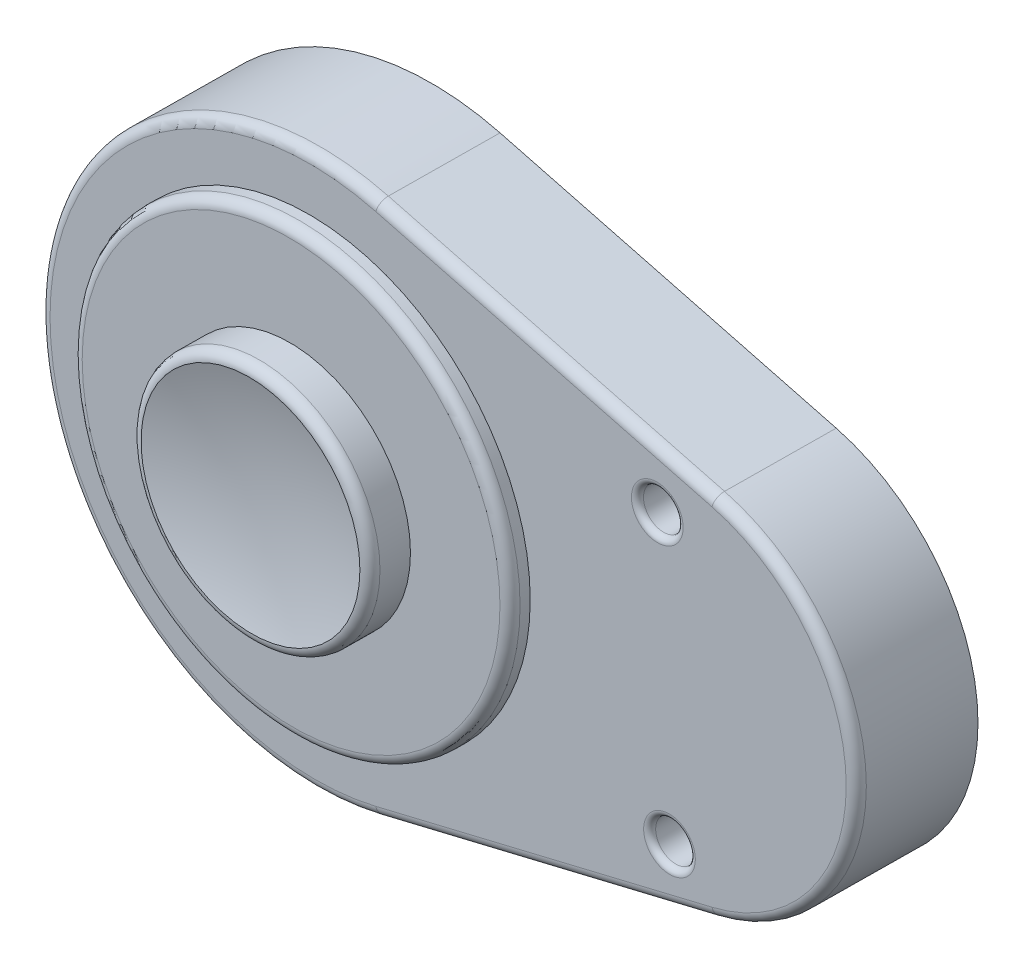
ISO-10303-21;
HEADER;
FILE_DESCRIPTION(('STEP AP214'),'2;1');
FILE_NAME('part.step','',(''),(''),'','','');
FILE_SCHEMA(('AUTOMOTIVE_DESIGN { 1 0 10303 214 1 1 1 1 }'));
ENDSEC;
DATA;
#1=APPLICATION_CONTEXT('core data for automotive mechanical design processes');
#2=APPLICATION_PROTOCOL_DEFINITION('international standard','automotive_design',2000,#1);
#3=PRODUCT_CONTEXT('',#1,'mechanical');
#4=PRODUCT('Part','Part','',(#3));
#5=PRODUCT_RELATED_PRODUCT_CATEGORY('part','',(#4));
#6=PRODUCT_DEFINITION_FORMATION('','',#4);
#7=PRODUCT_DEFINITION_CONTEXT('part definition',#1,'design');
#8=PRODUCT_DEFINITION('design','',#6,#7);
#9=PRODUCT_DEFINITION_SHAPE('','',#8);
#10=(LENGTH_UNIT() NAMED_UNIT(*) SI_UNIT(.MILLI.,.METRE.));
#11=(NAMED_UNIT(*) PLANE_ANGLE_UNIT() SI_UNIT($,.RADIAN.));
#12=(NAMED_UNIT(*) SI_UNIT($,.STERADIAN.) SOLID_ANGLE_UNIT());
#13=UNCERTAINTY_MEASURE_WITH_UNIT(LENGTH_MEASURE(1.E-05),#10,'distance_accuracy_value','');
#14=(GEOMETRIC_REPRESENTATION_CONTEXT(3) GLOBAL_UNCERTAINTY_ASSIGNED_CONTEXT((#13)) GLOBAL_UNIT_ASSIGNED_CONTEXT((#10,
#11,#12)) REPRESENTATION_CONTEXT('',''));
#15=CARTESIAN_POINT('',(0.,0.,0.));
#16=DIRECTION('',(0.,0.,1.));
#17=DIRECTION('',(1.,0.,0.));
#18=AXIS2_PLACEMENT_3D('',#15,#16,#17);
#19=CARTESIAN_POINT('',(-0.913899219910125,294.000000000001,89.995359814914));
#20=DIRECTION('',(0.0101544357767432,0.,-0.999948442387934));
#21=DIRECTION('',(-0.999948442387934,0.,-0.0101544357767432));
#22=AXIS2_PLACEMENT_3D('',#19,#20,#21);
#23=CYLINDRICAL_SURFACE('',#22,46.9225149813001);
#24=DIRECTION('',(0.0101544357767432,0.,-0.999948442387934));
#25=VECTOR('',#24,1.);
#26=CARTESIAN_POINT('',(10.3753588625768,339.544065709367,90.1100017717452));
#27=LINE('',#26,#25);
#28=CARTESIAN_POINT('',(10.4007449520186,339.544065709367,87.6101306657754));
#29=VERTEX_POINT('',#28);
#30=CARTESIAN_POINT('',(10.6799919358791,339.544065709367,60.1115485001072));
#31=VERTEX_POINT('',#30);
#32=EDGE_CURVE('E88',#29,#31,#27,.T.);
#33=ORIENTED_EDGE('',*,*,#32,.F.);
#34=CARTESIAN_POINT('',(-0.888513130468267,294.000000000001,87.4954887089442));
#35=DIRECTION('',(-0.0101544357767432,0.,0.999948442387934));
#36=DIRECTION('',(0.999948442387934,0.,0.0101544357767432));
#37=AXIS2_PLACEMENT_3D('',#34,#35,#36);
#38=CIRCLE('',#37,46.9225149813001);
#39=CARTESIAN_POINT('',(10.4007449520186,248.455934290634,87.6101306657754));
#40=VERTEX_POINT('',#39);
#41=EDGE_CURVE('E146',#29,#40,#38,.F.);
#42=ORIENTED_EDGE('',*,*,#41,.T.);
#43=DIRECTION('',(0.0101544357767432,0.,-0.999948442387934));
#44=VECTOR('',#43,1.);
#45=CARTESIAN_POINT('',(10.3753588625768,248.455934290634,90.1100017717452));
#46=LINE('',#45,#44);
#47=CARTESIAN_POINT('',(10.6799919358791,248.455934290634,60.1115485001072));
#48=VERTEX_POINT('',#47);
#49=EDGE_CURVE('E110',#40,#48,#46,.T.);
#50=ORIENTED_EDGE('',*,*,#49,.T.);
#51=CARTESIAN_POINT('',(-0.609266146607829,294.000000000001,59.996906543276));
#52=DIRECTION('',(-0.0101544357767432,0.,0.999948442387934));
#53=DIRECTION('',(0.999948442387934,0.,0.0101544357767432));
#54=AXIS2_PLACEMENT_3D('',#51,#52,#53);
#55=CIRCLE('',#54,46.9225149813001);
#56=EDGE_CURVE('E106',#48,#31,#55,.T.);
#57=ORIENTED_EDGE('',*,*,#56,.T.);
#58=EDGE_LOOP('',(#33,#42,#50,#57));
#59=FACE_BOUND('',#58,.T.);
#60=ADVANCED_FACE('F33',(#59),#23,.T.);
#61=CARTESIAN_POINT('',(10.3753588625768,339.544065709367,90.1100017717452));
#62=DIRECTION('',(-0.240593627323387,-0.970622860422481,-0.00244321850346071));
#63=DIRECTION('',(0.970625757413055,-0.240594345416375,0.));
#64=AXIS2_PLACEMENT_3D('',#61,#62,#63);
#65=PLANE('',#64);
#66=DIRECTION('',(0.0101544357767432,0.,-0.999948442387934));
#67=VECTOR('',#66,1.);
#68=CARTESIAN_POINT('',(-74.1083462192989,360.487665938941,89.2520731815606));
#69=LINE('',#68,#67);
#70=CARTESIAN_POINT('',(-74.082960129857,360.487665938941,86.7522020755908));
#71=VERTEX_POINT('',#70);
#72=CARTESIAN_POINT('',(-73.8037131459966,360.487665938941,59.2536199099226));
#73=VERTEX_POINT('',#72);
#74=EDGE_CURVE('E100',#71,#73,#69,.T.);
#75=ORIENTED_EDGE('',*,*,#74,.F.);
#76=DIRECTION('',(-0.970572817425582,0.240606032395866,-0.00985612749959888));
#77=VECTOR('',#76,1.);
#78=CARTESIAN_POINT('',(10.4007449520186,339.544065709367,87.6101306657754));
#79=LINE('',#78,#77);
#80=EDGE_CURVE('E94',#71,#29,#79,.F.);
#81=ORIENTED_EDGE('',*,*,#80,.T.);
#82=ORIENTED_EDGE('',*,*,#32,.T.);
#83=DIRECTION('',(-0.970572817425581,0.240606032395866,-0.00985612749959894));
#84=VECTOR('',#83,1.);
#85=CARTESIAN_POINT('',(10.6799919358791,339.544065709367,60.1115485001072));
#86=LINE('',#85,#84);
#87=EDGE_CURVE('E91',#31,#73,#86,.T.);
#88=ORIENTED_EDGE('',*,*,#87,.T.);
#89=EDGE_LOOP('',(#75,#81,#82,#88));
#90=FACE_BOUND('',#89,.T.);
#91=ADVANCED_FACE('F90',(#90),#65,.F.);
#92=CARTESIAN_POINT('',(-90.5890096909508,294.000000000001,89.0847127140735));
#93=DIRECTION('',(0.0101544357767432,0.,-0.999948442387934));
#94=DIRECTION('',(-0.999948442387934,0.,-0.0101544357767432));
#95=AXIS2_PLACEMENT_3D('',#92,#93,#94);
#96=CYLINDRICAL_SURFACE('',#95,68.5);
#97=DIRECTION('',(0.0101544357767432,0.,-0.999948442387934));
#98=VECTOR('',#97,1.);
#99=CARTESIAN_POINT('',(-74.1083462192989,227.512334061061,89.2520731815606));
#100=LINE('',#99,#98);
#101=CARTESIAN_POINT('',(-74.082960129857,227.512334061061,86.7522020755908));
#102=VERTEX_POINT('',#101);
#103=CARTESIAN_POINT('',(-73.8037131459966,227.512334061061,59.2536199099226));
#104=VERTEX_POINT('',#103);
#105=EDGE_CURVE('E124',#102,#104,#100,.T.);
#106=ORIENTED_EDGE('',*,*,#105,.F.);
#107=CARTESIAN_POINT('',(-90.563623601509,294.000000000001,86.5848416081037));
#108=DIRECTION('',(-0.0101544357767432,0.,0.999948442387934));
#109=DIRECTION('',(0.999948442387934,0.,0.0101544357767432));
#110=AXIS2_PLACEMENT_3D('',#107,#108,#109);
#111=CIRCLE('',#110,68.5);
#112=EDGE_CURVE('E49',#102,#71,#111,.F.);
#113=ORIENTED_EDGE('',*,*,#112,.T.);
#114=ORIENTED_EDGE('',*,*,#74,.T.);
#115=CARTESIAN_POINT('',(-90.2843766176485,294.000000000001,59.0862594424355));
#116=DIRECTION('',(-0.0101544357767432,0.,0.999948442387934));
#117=DIRECTION('',(0.999948442387934,0.,0.0101544357767432));
#118=AXIS2_PLACEMENT_3D('',#115,#116,#117);
#119=CIRCLE('',#118,68.5);
#120=EDGE_CURVE('E108',#73,#104,#119,.T.);
#121=ORIENTED_EDGE('',*,*,#120,.T.);
#122=EDGE_LOOP('',(#106,#113,#114,#121));
#123=FACE_BOUND('',#122,.T.);
#124=ADVANCED_FACE('F217',(#123),#96,.T.);
#125=CARTESIAN_POINT('',(-74.1083462192989,227.512334061061,89.2520731815606));
#126=DIRECTION('',(-0.240593627323385,0.970622860422482,-0.0024432185034609));
#127=DIRECTION('',(-0.970625757413055,-0.240594345416374,0.));
#128=AXIS2_PLACEMENT_3D('',#125,#126,#127);
#129=PLANE('',#128);
#130=ORIENTED_EDGE('',*,*,#49,.F.);
#131=DIRECTION('',(0.970572817425582,0.240606032395864,0.00985612749959883));
#132=VECTOR('',#131,1.);
#133=CARTESIAN_POINT('',(-74.082960129857,227.512334061061,86.7522020755908));
#134=LINE('',#133,#132);
#135=EDGE_CURVE('E57',#40,#102,#134,.F.);
#136=ORIENTED_EDGE('',*,*,#135,.T.);
#137=ORIENTED_EDGE('',*,*,#105,.T.);
#138=DIRECTION('',(0.970572817425582,0.240606032395864,0.00985612749959879));
#139=VECTOR('',#138,1.);
#140=CARTESIAN_POINT('',(-73.8037131459966,227.512334061061,59.2536199099226));
#141=LINE('',#140,#139);
#142=EDGE_CURVE('E121',#104,#48,#141,.T.);
#143=ORIENTED_EDGE('',*,*,#142,.T.);
#144=EDGE_LOOP('',(#130,#136,#137,#143));
#145=FACE_BOUND('',#144,.T.);
#146=ADVANCED_FACE('F209',(#145),#129,.F.);
#147=CARTESIAN_POINT('',(-0.913899219910125,294.000000000001,89.995359814914));
#148=DIRECTION('',(-0.0101544357767432,0.,0.999948442387934));
#149=DIRECTION('',(0.999948442387934,0.,0.0101544357767432));
#150=AXIS2_PLACEMENT_3D('',#147,#148,#149);
#151=PLANE('',#150);
#152=CARTESIAN_POINT('',(-0.913899219910086,259.067133874063,89.995359814914));
#153=DIRECTION('',(-0.0101544357767432,0.,0.999948442387934));
#154=DIRECTION('',(0.999948442387934,0.,0.0101544357767432));
#155=AXIS2_PLACEMENT_3D('',#152,#153,#154);
#156=CIRCLE('',#155,6.50000000000002);
#157=CARTESIAN_POINT('',(5.58576565561151,259.067133874063,90.0613636474629));
#158=VERTEX_POINT('',#157);
#159=EDGE_CURVE('E42',#158,#158,#156,.F.);
#160=ORIENTED_EDGE('',*,*,#159,.T.);
#161=EDGE_LOOP('',(#160));
#162=FACE_BOUND('',#161,.T.);
#163=CARTESIAN_POINT('',(-3.97874289420973,329.000000000001,89.9642364520113));
#164=DIRECTION('',(-0.0101544357767432,0.,0.999948442387934));
#165=DIRECTION('',(0.999948442387934,0.,0.0101544357767432));
#166=AXIS2_PLACEMENT_3D('',#163,#164,#165);
#167=CIRCLE('',#166,6.5);
#168=CARTESIAN_POINT('',(2.52092198131185,329.000000000001,90.0302402845602));
#169=VERTEX_POINT('',#168);
#170=EDGE_CURVE('E172',#169,#169,#167,.F.);
#171=ORIENTED_EDGE('',*,*,#170,.T.);
#172=EDGE_LOOP('',(#171));
#173=FACE_BOUND('',#172,.T.);
#174=DIRECTION('',(0.970572817425582,0.240606032395864,0.00985612749959883));
#175=VECTOR('',#174,1.);
#176=CARTESIAN_POINT('',(9.77387479426833,250.882491441691,90.1038937254866));
#177=LINE('',#176,#175);
#178=CARTESIAN_POINT('',(-74.7098302876073,229.938891212117,89.245965135302));
#179=VERTEX_POINT('',#178);
#180=CARTESIAN_POINT('',(9.77387479426833,250.882491441691,90.1038937254866));
#181=VERTEX_POINT('',#180);
#182=EDGE_CURVE('E141',#179,#181,#177,.T.);
#183=ORIENTED_EDGE('',*,*,#182,.T.);
#184=CARTESIAN_POINT('',(-0.913899219910125,294.000000000001,89.995359814914));
#185=DIRECTION('',(-0.0101544357767432,0.,0.999948442387934));
#186=DIRECTION('',(0.999948442387934,0.,0.0101544357767432));
#187=AXIS2_PLACEMENT_3D('',#184,#185,#186);
#188=CIRCLE('',#187,44.4225149813001);
#189=CARTESIAN_POINT('',(9.7738747942683,337.117508558311,90.1038937254866));
#190=VERTEX_POINT('',#189);
#191=EDGE_CURVE('E143',#181,#190,#188,.T.);
#192=ORIENTED_EDGE('',*,*,#191,.T.);
#193=DIRECTION('',(-0.970572817425582,0.240606032395866,-0.00985612749959888));
#194=VECTOR('',#193,1.);
#195=CARTESIAN_POINT('',(-74.7098302876074,358.061108787885,89.2459651353019));
#196=LINE('',#195,#194);
#197=CARTESIAN_POINT('',(-74.7098302876074,358.061108787885,89.2459651353019));
#198=VERTEX_POINT('',#197);
#199=EDGE_CURVE('E136',#190,#198,#196,.T.);
#200=ORIENTED_EDGE('',*,*,#199,.T.);
#201=CARTESIAN_POINT('',(-90.5890096909508,294.000000000001,89.0847127140735));
#202=DIRECTION('',(-0.0101544357767432,0.,0.999948442387934));
#203=DIRECTION('',(0.999948442387934,0.,0.0101544357767432));
#204=AXIS2_PLACEMENT_3D('',#201,#202,#203);
#205=CIRCLE('',#204,66.);
#206=EDGE_CURVE('E138',#198,#179,#205,.T.);
#207=ORIENTED_EDGE('',*,*,#206,.T.);
#208=EDGE_LOOP('',(#183,#192,#200,#207));
#209=FACE_BOUND('',#208,.T.);
#210=CARTESIAN_POINT('',(-90.9046190889751,294.000000000001,89.0815077134686));
#211=DIRECTION('',(-0.0101544357767432,0.,0.999948442387934));
#212=DIRECTION('',(0.999948442387934,0.,0.0101544357767432));
#213=AXIS2_PLACEMENT_3D('',#210,#211,#212);
#214=CIRCLE('',#213,55.);
#215=CARTESIAN_POINT('',(-35.9074547576387,294.000000000001,89.6400016811895));
#216=VERTEX_POINT('',#215);
#217=EDGE_CURVE('E99',#216,#216,#214,.T.);
#218=ORIENTED_EDGE('',*,*,#217,.F.);
#219=EDGE_LOOP('',(#218));
#220=FACE_BOUND('',#219,.T.);
#221=ADVANCED_FACE('F178',(#162,#173,#209,#220),#151,.T.);
#222=CARTESIAN_POINT('',(-0.609266146607829,294.000000000001,59.996906543276));
#223=DIRECTION('',(-0.0101544357767432,0.,0.999948442387934));
#224=DIRECTION('',(0.999948442387934,0.,0.0101544357767432));
#225=AXIS2_PLACEMENT_3D('',#222,#223,#224);
#226=PLANE('',#225);
#227=CARTESIAN_POINT('',(-3.67410982090744,329.000000000001,59.9657831803733));
#228=DIRECTION('',(-0.0101544357767432,0.,0.999948442387934));
#229=DIRECTION('',(0.999948442387934,0.,0.0101544357767432));
#230=AXIS2_PLACEMENT_3D('',#227,#228,#229);
#231=CIRCLE('',#230,3.0000000000433);
#232=CARTESIAN_POINT('',(-0.674264493700337,329.000000000001,59.9962464877039));
#233=VERTEX_POINT('',#232);
#234=EDGE_CURVE('E130',#233,#233,#231,.T.);
#235=ORIENTED_EDGE('',*,*,#234,.T.);
#236=EDGE_LOOP('',(#235));
#237=FACE_BOUND('',#236,.T.);
#238=CARTESIAN_POINT('',(-0.60926614660779,259.067133874063,59.996906543276));
#239=DIRECTION('',(-0.0101544357767432,0.,0.999948442387934));
#240=DIRECTION('',(0.999948442387934,0.,0.0101544357767432));
#241=AXIS2_PLACEMENT_3D('',#238,#239,#240);
#242=CIRCLE('',#241,3.00000000022555);
#243=CARTESIAN_POINT('',(2.39057918078155,259.067133874063,60.0273698506085));
#244=VERTEX_POINT('',#243);
#245=EDGE_CURVE('E135',#244,#244,#242,.T.);
#246=ORIENTED_EDGE('',*,*,#245,.T.);
#247=EDGE_LOOP('',(#246));
#248=FACE_BOUND('',#247,.T.);
#249=ORIENTED_EDGE('',*,*,#56,.F.);
#250=ORIENTED_EDGE('',*,*,#142,.F.);
#251=ORIENTED_EDGE('',*,*,#120,.F.);
#252=ORIENTED_EDGE('',*,*,#87,.F.);
#253=EDGE_LOOP('',(#249,#250,#251,#252));
#254=FACE_BOUND('',#253,.T.);
#255=ADVANCED_FACE('F104',(#237,#248,#254),#226,.F.);
#256=CARTESIAN_POINT('',(-90.9553912678588,294.000000000001,94.0812499254083));
#257=DIRECTION('',(0.0101544357767432,0.,-0.999948442387934));
#258=DIRECTION('',(-0.999948442387934,0.,-0.0101544357767432));
#259=AXIS2_PLACEMENT_3D('',#256,#257,#258);
#260=CYLINDRICAL_SURFACE('',#259,55.);
#261=CARTESIAN_POINT('',(-90.930005178417,294.000000000001,91.5813788194384));
#262=DIRECTION('',(-0.0101544357767432,0.,0.999948442387934));
#263=DIRECTION('',(0.999948442387934,0.,0.0101544357767432));
#264=AXIS2_PLACEMENT_3D('',#261,#262,#263);
#265=CIRCLE('',#264,55.);
#266=CARTESIAN_POINT('',(-35.9328408470806,294.000000000001,92.1398727871593));
#267=VERTEX_POINT('',#266);
#268=EDGE_CURVE('E153',#267,#267,#265,.F.);
#269=ORIENTED_EDGE('',*,*,#268,.T.);
#270=EDGE_LOOP('',(#269));
#271=FACE_BOUND('',#270,.T.);
#272=ORIENTED_EDGE('',*,*,#217,.T.);
#273=EDGE_LOOP('',(#272));
#274=FACE_BOUND('',#273,.T.);
#275=ADVANCED_FACE('F206',(#271,#274),#260,.T.);
#276=CARTESIAN_POINT('',(-90.9553912678588,294.000000000001,94.0812499254083));
#277=DIRECTION('',(-0.0101544357767432,0.,0.999948442387934));
#278=DIRECTION('',(0.999948442387934,0.,0.0101544357767432));
#279=AXIS2_PLACEMENT_3D('',#276,#277,#278);
#280=PLANE('',#279);
#281=CARTESIAN_POINT('',(-90.9553912678588,294.000000000001,94.0812499254083));
#282=DIRECTION('',(-0.0101544357767432,0.,0.999948442387934));
#283=DIRECTION('',(0.999948442387934,0.,0.0101544357767432));
#284=AXIS2_PLACEMENT_3D('',#281,#282,#283);
#285=CIRCLE('',#284,52.5);
#286=CARTESIAN_POINT('',(-38.4580980424923,294.000000000001,94.6143578036873));
#287=VERTEX_POINT('',#286);
#288=EDGE_CURVE('E150',#287,#287,#285,.T.);
#289=ORIENTED_EDGE('',*,*,#288,.T.);
#290=EDGE_LOOP('',(#289));
#291=FACE_BOUND('',#290,.T.);
#292=CARTESIAN_POINT('',(-90.9553912678588,294.000000000001,94.0812499254083));
#293=DIRECTION('',(-0.0101544357767432,0.,0.999948442387934));
#294=DIRECTION('',(0.999948442387934,0.,0.0101544357767432));
#295=AXIS2_PLACEMENT_3D('',#292,#293,#294);
#296=CIRCLE('',#295,30.);
#297=CARTESIAN_POINT('',(-60.9569379962208,294.000000000001,94.3858829987106));
#298=VERTEX_POINT('',#297);
#299=EDGE_CURVE('E139',#298,#298,#296,.T.);
#300=ORIENTED_EDGE('',*,*,#299,.F.);
#301=EDGE_LOOP('',(#300));
#302=FACE_BOUND('',#301,.T.);
#303=ADVANCED_FACE('F284',(#291,#302),#280,.T.);
#304=CARTESIAN_POINT('',(-91.0569356256263,294.000000000001,104.080734349288));
#305=DIRECTION('',(0.0101544357767432,0.,-0.999948442387934));
#306=DIRECTION('',(-0.999948442387934,0.,-0.0101544357767432));
#307=AXIS2_PLACEMENT_3D('',#304,#305,#306);
#308=CYLINDRICAL_SURFACE('',#307,30.);
#309=CARTESIAN_POINT('',(-91.0315495361844,294.000000000001,101.580863243318));
#310=DIRECTION('',(-0.0101544357767432,0.,0.999948442387934));
#311=DIRECTION('',(0.999948442387934,0.,0.0101544357767432));
#312=AXIS2_PLACEMENT_3D('',#309,#310,#311);
#313=CIRCLE('',#312,30.);
#314=CARTESIAN_POINT('',(-61.0330962645464,294.000000000001,101.88549631662));
#315=VERTEX_POINT('',#314);
#316=EDGE_CURVE('E156',#315,#315,#313,.F.);
#317=ORIENTED_EDGE('',*,*,#316,.T.);
#318=EDGE_LOOP('',(#317));
#319=FACE_BOUND('',#318,.T.);
#320=ORIENTED_EDGE('',*,*,#299,.T.);
#321=EDGE_LOOP('',(#320));
#322=FACE_BOUND('',#321,.T.);
#323=ADVANCED_FACE('F281',(#319,#322),#308,.T.);
#324=CARTESIAN_POINT('',(-91.996538261093,294.000000000001,196.607213658996));
#325=DIRECTION('',(0.,0.,1.));
#326=DIRECTION('',(1.,0.,0.));
#327=AXIS2_PLACEMENT_3D('',#324,#325,#326);
#328=SPHERICAL_SURFACE('',#327,96.5312499999999);
#329=CARTESIAN_POINT('',(-91.996538261093,294.000000000001,196.607213658996));
#330=DIRECTION('',(-0.0101544357767432,0.,0.999948442387934));
#331=DIRECTION('',(0.999948442387934,0.,0.0101544357767432));
#332=AXIS2_PLACEMENT_3D('',#329,#330,#331);
#333=SPHERICAL_SURFACE('',#332,96.5312499999999);
#334=CARTESIAN_POINT('',(-91.0569356256263,294.000000000001,104.080734349288));
#335=DIRECTION('',(-0.0101544357767432,0.,0.999948442387934));
#336=DIRECTION('',(0.999948442387934,0.,0.0101544357767432));
#337=AXIS2_PLACEMENT_3D('',#334,#335,#336);
#338=CIRCLE('',#337,27.5);
#339=CARTESIAN_POINT('',(-63.5583534599581,294.000000000001,104.359981333148));
#340=VERTEX_POINT('',#339);
#341=EDGE_CURVE('E37',#340,#340,#338,.T.);
#342=ORIENTED_EDGE('',*,*,#341,.T.);
#343=EDGE_LOOP('',(#342));
#344=FACE_BOUND('',#343,.T.);
#345=ADVANCED_FACE('F35',(#344),#333,.F.);
#346=CARTESIAN_POINT('',(-0.710810504375222,259.067133874063,69.9963909671554));
#347=DIRECTION('',(-0.0101544357767432,0.,0.999948442387934));
#348=DIRECTION('',(0.999948442387934,0.,0.0101544357767432));
#349=AXIS2_PLACEMENT_3D('',#346,#347,#348);
#350=CYLINDRICAL_SURFACE('',#349,5.00000000000002);
#351=CARTESIAN_POINT('',(-0.898667566244971,259.067133874063,88.4954371513321));
#352=DIRECTION('',(-0.0101544357767432,0.,0.999948442387934));
#353=DIRECTION('',(0.999948442387934,0.,0.0101544357767432));
#354=AXIS2_PLACEMENT_3D('',#351,#352,#353);
#355=CIRCLE('',#354,5.00000000000002);
#356=CARTESIAN_POINT('',(4.10107464569472,259.067133874063,88.5462093302158));
#357=VERTEX_POINT('',#356);
#358=EDGE_CURVE('E160',#357,#357,#355,.T.);
#359=ORIENTED_EDGE('',*,*,#358,.T.);
#360=EDGE_LOOP('',(#359));
#361=FACE_BOUND('',#360,.T.);
#362=CARTESIAN_POINT('',(-0.710810504375222,259.067133874063,69.9963909671554));
#363=DIRECTION('',(-0.0101544357767432,0.,0.999948442387934));
#364=DIRECTION('',(0.999948442387934,0.,0.0101544357767432));
#365=AXIS2_PLACEMENT_3D('',#362,#363,#364);
#366=CIRCLE('',#365,5.00000000000002);
#367=CARTESIAN_POINT('',(4.28893170756447,259.067133874063,70.0471631460391));
#368=VERTEX_POINT('',#367);
#369=EDGE_CURVE('E115',#368,#368,#366,.T.);
#370=ORIENTED_EDGE('',*,*,#369,.F.);
#371=EDGE_LOOP('',(#370));
#372=FACE_BOUND('',#371,.T.);
#373=ADVANCED_FACE('F189',(#361,#372),#350,.F.);
#374=CARTESIAN_POINT('',(-0.710810504375222,259.067133874063,69.9963909671554));
#375=DIRECTION('',(-0.0101544357767432,0.,0.999948442387934));
#376=DIRECTION('',(0.999948442387934,0.,0.0101544357767432));
#377=AXIS2_PLACEMENT_3D('',#374,#375,#376);
#378=PLANE('',#377);
#379=CARTESIAN_POINT('',(-0.710810504375222,259.067133874063,69.9963909671554));
#380=DIRECTION('',(-0.0101544357767432,0.,0.999948442387934));
#381=DIRECTION('',(0.999948442387934,0.,0.0101544357767432));
#382=AXIS2_PLACEMENT_3D('',#379,#380,#381);
#383=CIRCLE('',#382,3.00000000022555);
#384=CARTESIAN_POINT('',(2.28903482301412,259.067133874063,70.0268542744879));
#385=VERTEX_POINT('',#384);
#386=EDGE_CURVE('E132',#385,#385,#383,.T.);
#387=ORIENTED_EDGE('',*,*,#386,.F.);
#388=EDGE_LOOP('',(#387));
#389=FACE_BOUND('',#388,.T.);
#390=ORIENTED_EDGE('',*,*,#369,.T.);
#391=EDGE_LOOP('',(#390));
#392=FACE_BOUND('',#391,.T.);
#393=ADVANCED_FACE('F192',(#389,#392),#378,.T.);
#394=CARTESIAN_POINT('',(-3.77565417867487,329.000000000001,69.9652676042526));
#395=DIRECTION('',(-0.0101544357767432,0.,0.999948442387934));
#396=DIRECTION('',(0.999948442387934,0.,0.0101544357767432));
#397=AXIS2_PLACEMENT_3D('',#394,#395,#396);
#398=CYLINDRICAL_SURFACE('',#397,5.);
#399=CARTESIAN_POINT('',(-3.96351124054462,329.000000000001,88.4643137884294));
#400=DIRECTION('',(-0.0101544357767432,0.,0.999948442387934));
#401=DIRECTION('',(0.999948442387934,0.,0.0101544357767432));
#402=AXIS2_PLACEMENT_3D('',#399,#400,#401);
#403=CIRCLE('',#402,5.);
#404=CARTESIAN_POINT('',(1.03623097139506,329.000000000001,88.5150859673131));
#405=VERTEX_POINT('',#404);
#406=EDGE_CURVE('E11',#405,#405,#403,.T.);
#407=ORIENTED_EDGE('',*,*,#406,.T.);
#408=EDGE_LOOP('',(#407));
#409=FACE_BOUND('',#408,.T.);
#410=CARTESIAN_POINT('',(-3.77565417867487,329.000000000001,69.9652676042526));
#411=DIRECTION('',(-0.0101544357767432,0.,0.999948442387934));
#412=DIRECTION('',(0.999948442387934,0.,0.0101544357767432));
#413=AXIS2_PLACEMENT_3D('',#410,#411,#412);
#414=CIRCLE('',#413,5.);
#415=CARTESIAN_POINT('',(1.22408803326481,329.000000000001,70.0160397831364));
#416=VERTEX_POINT('',#415);
#417=EDGE_CURVE('E112',#416,#416,#414,.T.);
#418=ORIENTED_EDGE('',*,*,#417,.F.);
#419=EDGE_LOOP('',(#418));
#420=FACE_BOUND('',#419,.T.);
#421=ADVANCED_FACE('F259',(#409,#420),#398,.F.);
#422=CARTESIAN_POINT('',(-3.77565417867487,329.000000000001,69.9652676042526));
#423=DIRECTION('',(-0.0101544357767432,0.,0.999948442387934));
#424=DIRECTION('',(0.999948442387934,0.,0.0101544357767432));
#425=AXIS2_PLACEMENT_3D('',#422,#423,#424);
#426=PLANE('',#425);
#427=CARTESIAN_POINT('',(-3.77565417867487,329.000000000001,69.9652676042526));
#428=DIRECTION('',(-0.0101544357767432,0.,0.999948442387934));
#429=DIRECTION('',(0.999948442387934,0.,0.0101544357767432));
#430=AXIS2_PLACEMENT_3D('',#427,#428,#429);
#431=CIRCLE('',#430,3.0000000000433);
#432=CARTESIAN_POINT('',(-0.775808851467769,329.000000000001,69.9957309115833));
#433=VERTEX_POINT('',#432);
#434=EDGE_CURVE('E127',#433,#433,#431,.T.);
#435=ORIENTED_EDGE('',*,*,#434,.F.);
#436=EDGE_LOOP('',(#435));
#437=FACE_BOUND('',#436,.T.);
#438=ORIENTED_EDGE('',*,*,#417,.T.);
#439=EDGE_LOOP('',(#438));
#440=FACE_BOUND('',#439,.T.);
#441=ADVANCED_FACE('F262',(#437,#440),#426,.T.);
#442=CARTESIAN_POINT('',(-3.65296229209155,329.000000000001,57.8833003162603));
#443=DIRECTION('',(-0.0101544357767432,0.,0.999948442387934));
#444=DIRECTION('',(0.999948442387934,0.,0.0101544357767432));
#445=AXIS2_PLACEMENT_3D('',#442,#443,#444);
#446=CYLINDRICAL_SURFACE('',#445,3.0000000000433);
#447=ORIENTED_EDGE('',*,*,#434,.T.);
#448=EDGE_LOOP('',(#447));
#449=FACE_BOUND('',#448,.T.);
#450=ORIENTED_EDGE('',*,*,#234,.F.);
#451=EDGE_LOOP('',(#450));
#452=FACE_BOUND('',#451,.T.);
#453=ADVANCED_FACE('F267',(#449,#452),#446,.F.);
#454=CARTESIAN_POINT('',(-0.588118617791899,259.067133874063,57.914423679163));
#455=DIRECTION('',(-0.0101544357767432,0.,0.999948442387934));
#456=DIRECTION('',(0.999948442387934,0.,0.0101544357767432));
#457=AXIS2_PLACEMENT_3D('',#454,#455,#456);
#458=CYLINDRICAL_SURFACE('',#457,3.00000000022555);
#459=ORIENTED_EDGE('',*,*,#386,.T.);
#460=EDGE_LOOP('',(#459));
#461=FACE_BOUND('',#460,.T.);
#462=ORIENTED_EDGE('',*,*,#245,.F.);
#463=EDGE_LOOP('',(#462));
#464=FACE_BOUND('',#463,.T.);
#465=ADVANCED_FACE('F244',(#461,#464),#458,.F.);
#466=CARTESIAN_POINT('',(-90.563623601509,294.000000000001,86.5848416081037));
#467=DIRECTION('',(-0.0101544357767432,0.,0.999948442387934));
#468=DIRECTION('',(0.999948442387934,0.,0.0101544357767432));
#469=AXIS2_PLACEMENT_3D('',#466,#467,#468);
#470=TOROIDAL_SURFACE('',#469,66.,2.5);
#471=CARTESIAN_POINT('',(-74.6844441981655,358.061108787885,86.7460940293321));
#472=DIRECTION('',(0.970572817425582,-0.240606032395865,0.0098561274995992));
#473=DIRECTION('',(0.240617719873284,0.970619963159105,0.));
#474=AXIS2_PLACEMENT_3D('',#471,#472,#473);
#475=CIRCLE('',#474,2.5);
#476=EDGE_CURVE('E165',#71,#198,#475,.T.);
#477=ORIENTED_EDGE('',*,*,#476,.F.);
#478=ORIENTED_EDGE('',*,*,#112,.F.);
#479=CARTESIAN_POINT('',(-74.6844441981655,229.938891212117,86.7460940293321));
#480=DIRECTION('',(0.970572817425581,0.240606032395868,0.00985612749959924));
#481=DIRECTION('',(-0.240617719873287,0.970619963159104,0.));
#482=AXIS2_PLACEMENT_3D('',#479,#480,#481);
#483=CIRCLE('',#482,2.5);
#484=EDGE_CURVE('E131',#179,#102,#483,.T.);
#485=ORIENTED_EDGE('',*,*,#484,.F.);
#486=ORIENTED_EDGE('',*,*,#206,.F.);
#487=EDGE_LOOP('',(#477,#478,#485,#486));
#488=FACE_BOUND('',#487,.T.);
#489=ADVANCED_FACE('F240',(#488),#470,.T.);
#490=CARTESIAN_POINT('',(9.79926088371015,250.882491441691,87.6040226195168));
#491=DIRECTION('',(-0.970572817425582,-0.240606032395864,-0.00985612749959883));
#492=DIRECTION('',(0.240617719873283,-0.970619963159105,0.));
#493=AXIS2_PLACEMENT_3D('',#490,#491,#492);
#494=CYLINDRICAL_SURFACE('',#493,2.5);
#495=ORIENTED_EDGE('',*,*,#484,.T.);
#496=ORIENTED_EDGE('',*,*,#135,.F.);
#497=CARTESIAN_POINT('',(9.79926088371019,250.882491441691,87.6040226195168));
#498=DIRECTION('',(0.970572817425582,0.240606032395865,0.00985612749959858));
#499=DIRECTION('',(-0.240617719873284,0.970619963159105,0.));
#500=AXIS2_PLACEMENT_3D('',#497,#498,#499);
#501=CIRCLE('',#500,2.5);
#502=EDGE_CURVE('E163',#181,#40,#501,.T.);
#503=ORIENTED_EDGE('',*,*,#502,.F.);
#504=ORIENTED_EDGE('',*,*,#182,.F.);
#505=EDGE_LOOP('',(#495,#496,#503,#504));
#506=FACE_BOUND('',#505,.T.);
#507=ADVANCED_FACE('F236',(#506),#494,.T.);
#508=CARTESIAN_POINT('',(9.79926088371021,337.117508558311,87.6040226195168));
#509=DIRECTION('',(0.970572817425582,-0.240606032395866,0.00985612749959888));
#510=DIRECTION('',(0.240617719873285,0.970619963159104,0.));
#511=AXIS2_PLACEMENT_3D('',#508,#509,#510);
#512=CYLINDRICAL_SURFACE('',#511,2.5);
#513=ORIENTED_EDGE('',*,*,#476,.T.);
#514=ORIENTED_EDGE('',*,*,#199,.F.);
#515=CARTESIAN_POINT('',(9.79926088371015,337.117508558311,87.6040226195168));
#516=DIRECTION('',(0.970572817425582,-0.240606032395865,0.00985612749959723));
#517=DIRECTION('',(0.240617719873284,0.970619963159105,0.));
#518=AXIS2_PLACEMENT_3D('',#515,#516,#517);
#519=CIRCLE('',#518,2.5);
#520=EDGE_CURVE('E161',#29,#190,#519,.T.);
#521=ORIENTED_EDGE('',*,*,#520,.F.);
#522=ORIENTED_EDGE('',*,*,#80,.F.);
#523=EDGE_LOOP('',(#513,#514,#521,#522));
#524=FACE_BOUND('',#523,.T.);
#525=ADVANCED_FACE('F232',(#524),#512,.T.);
#526=CARTESIAN_POINT('',(-0.888513130468267,294.000000000001,87.4954887089442));
#527=DIRECTION('',(-0.0101544357767432,0.,0.999948442387934));
#528=DIRECTION('',(0.999948442387934,0.,0.0101544357767432));
#529=AXIS2_PLACEMENT_3D('',#526,#527,#528);
#530=TOROIDAL_SURFACE('',#529,44.4225149813001,2.5);
#531=ORIENTED_EDGE('',*,*,#502,.T.);
#532=ORIENTED_EDGE('',*,*,#41,.F.);
#533=ORIENTED_EDGE('',*,*,#520,.T.);
#534=ORIENTED_EDGE('',*,*,#191,.F.);
#535=EDGE_LOOP('',(#531,#532,#533,#534));
#536=FACE_BOUND('',#535,.T.);
#537=ADVANCED_FACE('F228',(#536),#530,.T.);
#538=CARTESIAN_POINT('',(-90.930005178417,294.000000000001,91.5813788194385));
#539=DIRECTION('',(-0.0101544357767432,0.,0.999948442387934));
#540=DIRECTION('',(0.999948442387934,0.,0.0101544357767432));
#541=AXIS2_PLACEMENT_3D('',#538,#539,#540);
#542=TOROIDAL_SURFACE('',#541,52.5,2.5);
#543=ORIENTED_EDGE('',*,*,#268,.F.);
#544=EDGE_LOOP('',(#543));
#545=FACE_BOUND('',#544,.T.);
#546=ORIENTED_EDGE('',*,*,#288,.F.);
#547=EDGE_LOOP('',(#546));
#548=FACE_BOUND('',#547,.T.);
#549=ADVANCED_FACE('F231',(#545,#548),#542,.T.);
#550=CARTESIAN_POINT('',(-91.0315495361844,294.000000000001,101.580863243318));
#551=DIRECTION('',(-0.0101544357767432,0.,0.999948442387934));
#552=DIRECTION('',(0.999948442387934,0.,0.0101544357767432));
#553=AXIS2_PLACEMENT_3D('',#550,#551,#552);
#554=TOROIDAL_SURFACE('',#553,27.5,2.5);
#555=ORIENTED_EDGE('',*,*,#316,.F.);
#556=EDGE_LOOP('',(#555));
#557=FACE_BOUND('',#556,.T.);
#558=ORIENTED_EDGE('',*,*,#341,.F.);
#559=EDGE_LOOP('',(#558));
#560=FACE_BOUND('',#559,.T.);
#561=ADVANCED_FACE('F185',(#557,#560),#554,.T.);
#562=CARTESIAN_POINT('',(-0.898667566244971,259.067133874063,88.4954371513321));
#563=DIRECTION('',(-0.0101544357767432,0.,0.999948442387934));
#564=DIRECTION('',(0.999948442387934,0.,0.0101544357767432));
#565=AXIS2_PLACEMENT_3D('',#562,#563,#564);
#566=TOROIDAL_SURFACE('',#565,6.50000000000002,1.5);
#567=ORIENTED_EDGE('',*,*,#159,.F.);
#568=EDGE_LOOP('',(#567));
#569=FACE_BOUND('',#568,.T.);
#570=ORIENTED_EDGE('',*,*,#358,.F.);
#571=EDGE_LOOP('',(#570));
#572=FACE_BOUND('',#571,.T.);
#573=ADVANCED_FACE('F181',(#569,#572),#566,.T.);
#574=CARTESIAN_POINT('',(-3.96351124054462,329.000000000001,88.4643137884294));
#575=DIRECTION('',(-0.0101544357767432,0.,0.999948442387934));
#576=DIRECTION('',(0.999948442387934,0.,0.0101544357767432));
#577=AXIS2_PLACEMENT_3D('',#574,#575,#576);
#578=TOROIDAL_SURFACE('',#577,6.5,1.5);
#579=ORIENTED_EDGE('',*,*,#170,.F.);
#580=EDGE_LOOP('',(#579));
#581=FACE_BOUND('',#580,.T.);
#582=ORIENTED_EDGE('',*,*,#406,.F.);
#583=EDGE_LOOP('',(#582));
#584=FACE_BOUND('',#583,.T.);
#585=ADVANCED_FACE('F184',(#581,#584),#578,.T.);
#586=CLOSED_SHELL('',(#60,#91,#124,#146,#221,#255,#275,#303,#323,#345,#373,#393,#421,#441,#453,
#465,#489,#507,#525,#537,#549,#561,#573,#585));
#587=MANIFOLD_SOLID_BREP('B2',#586);
#588=ADVANCED_BREP_SHAPE_REPRESENTATION('',(#18,#587),#14);
#589=SHAPE_DEFINITION_REPRESENTATION(#9,#588);
ENDSEC;
END-ISO-10303-21;
